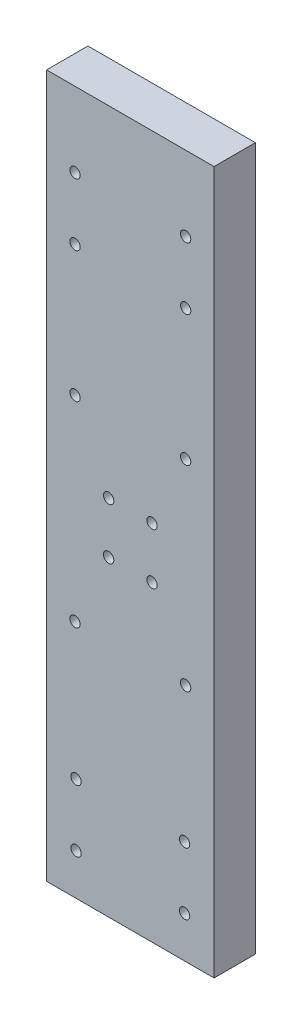
ISO-10303-21;
HEADER;
FILE_DESCRIPTION(('STEP AP214'),'2;1');
FILE_NAME('part.step','',(''),(''),'','','');
FILE_SCHEMA(('AUTOMOTIVE_DESIGN { 1 0 10303 214 1 1 1 1 }'));
ENDSEC;
DATA;
#1=APPLICATION_CONTEXT('core data for automotive mechanical design processes');
#2=APPLICATION_PROTOCOL_DEFINITION('international standard','automotive_design',2000,#1);
#3=PRODUCT_CONTEXT('',#1,'mechanical');
#4=PRODUCT('Part','Part','',(#3));
#5=PRODUCT_RELATED_PRODUCT_CATEGORY('part','',(#4));
#6=PRODUCT_DEFINITION_FORMATION('','',#4);
#7=PRODUCT_DEFINITION_CONTEXT('part definition',#1,'design');
#8=PRODUCT_DEFINITION('design','',#6,#7);
#9=PRODUCT_DEFINITION_SHAPE('','',#8);
#10=(LENGTH_UNIT() NAMED_UNIT(*) SI_UNIT(.MILLI.,.METRE.));
#11=(NAMED_UNIT(*) PLANE_ANGLE_UNIT() SI_UNIT($,.RADIAN.));
#12=(NAMED_UNIT(*) SI_UNIT($,.STERADIAN.) SOLID_ANGLE_UNIT());
#13=UNCERTAINTY_MEASURE_WITH_UNIT(LENGTH_MEASURE(1.E-05),#10,'distance_accuracy_value','');
#14=(GEOMETRIC_REPRESENTATION_CONTEXT(3) GLOBAL_UNCERTAINTY_ASSIGNED_CONTEXT((#13)) GLOBAL_UNIT_ASSIGNED_CONTEXT((#10,
#11,#12)) REPRESENTATION_CONTEXT('',''));
#15=CARTESIAN_POINT('',(0.,0.,0.));
#16=DIRECTION('',(0.,0.,1.));
#17=DIRECTION('',(1.,0.,0.));
#18=AXIS2_PLACEMENT_3D('',#15,#16,#17);
#19=CARTESIAN_POINT('',(0.,0.,4.));
#20=DIRECTION('',(0.,0.,-1.));
#21=DIRECTION('',(-1.,0.,0.));
#22=AXIS2_PLACEMENT_3D('',#19,#20,#21);
#23=PLANE('',#22);
#24=CARTESIAN_POINT('',(13.350000000001,4.,4.));
#25=DIRECTION('',(0.,0.,1.));
#26=DIRECTION('',(-1.,0.,0.));
#27=AXIS2_PLACEMENT_3D('',#24,#25,#26);
#28=CIRCLE('',#27,0.499999999999995);
#29=CARTESIAN_POINT('',(12.850000000001,4.,4.));
#30=VERTEX_POINT('',#29);
#31=EDGE_CURVE('E192',#30,#30,#28,.T.);
#32=ORIENTED_EDGE('',*,*,#31,.F.);
#33=EDGE_LOOP('',(#32));
#34=FACE_BOUND('',#33,.T.);
#35=CARTESIAN_POINT('',(2.84999999999999,4.,4.));
#36=DIRECTION('',(0.,0.,1.));
#37=DIRECTION('',(1.,0.,0.));
#38=AXIS2_PLACEMENT_3D('',#35,#36,#37);
#39=CIRCLE('',#38,0.499999999999999);
#40=CARTESIAN_POINT('',(3.34999999999999,4.,4.));
#41=VERTEX_POINT('',#40);
#42=EDGE_CURVE('E180',#41,#41,#39,.T.);
#43=ORIENTED_EDGE('',*,*,#42,.F.);
#44=EDGE_LOOP('',(#43));
#45=FACE_BOUND('',#44,.T.);
#46=CARTESIAN_POINT('',(2.75000000000003,42.11,4.));
#47=DIRECTION('',(0.,0.,1.));
#48=DIRECTION('',(1.,0.,0.));
#49=AXIS2_PLACEMENT_3D('',#46,#47,#48);
#50=CIRCLE('',#49,0.499999999999999);
#51=CARTESIAN_POINT('',(3.25000000000003,42.11,4.));
#52=VERTEX_POINT('',#51);
#53=EDGE_CURVE('E168',#52,#52,#50,.T.);
#54=ORIENTED_EDGE('',*,*,#53,.F.);
#55=EDGE_LOOP('',(#54));
#56=FACE_BOUND('',#55,.T.);
#57=CARTESIAN_POINT('',(13.45,42.11,4.));
#58=DIRECTION('',(0.,0.,1.));
#59=DIRECTION('',(1.,0.,0.));
#60=AXIS2_PLACEMENT_3D('',#57,#58,#59);
#61=CIRCLE('',#60,0.499999999999999);
#62=CARTESIAN_POINT('',(13.95,42.11,4.));
#63=VERTEX_POINT('',#62);
#64=EDGE_CURVE('E156',#63,#63,#61,.T.);
#65=ORIENTED_EDGE('',*,*,#64,.F.);
#66=EDGE_LOOP('',(#65));
#67=FACE_BOUND('',#66,.T.);
#68=CARTESIAN_POINT('',(2.75000000000003,23.15,4.));
#69=DIRECTION('',(0.,0.,1.));
#70=DIRECTION('',(1.,0.,0.));
#71=AXIS2_PLACEMENT_3D('',#68,#69,#70);
#72=CIRCLE('',#71,0.499999999999999);
#73=CARTESIAN_POINT('',(3.25000000000003,23.15,4.));
#74=VERTEX_POINT('',#73);
#75=EDGE_CURVE('E144',#74,#74,#72,.T.);
#76=ORIENTED_EDGE('',*,*,#75,.F.);
#77=EDGE_LOOP('',(#76));
#78=FACE_BOUND('',#77,.T.);
#79=CARTESIAN_POINT('',(13.4500000000001,23.15,4.));
#80=DIRECTION('',(0.,0.,1.));
#81=DIRECTION('',(1.,0.,0.));
#82=AXIS2_PLACEMENT_3D('',#79,#80,#81);
#83=CIRCLE('',#82,0.499999999999999);
#84=CARTESIAN_POINT('',(13.9500000000001,23.15,4.));
#85=VERTEX_POINT('',#84);
#86=EDGE_CURVE('E132',#85,#85,#83,.T.);
#87=ORIENTED_EDGE('',*,*,#86,.F.);
#88=EDGE_LOOP('',(#87));
#89=FACE_BOUND('',#88,.T.);
#90=CARTESIAN_POINT('',(10.2000000000001,30.15,4.));
#91=DIRECTION('',(0.,0.,1.));
#92=DIRECTION('',(1.,0.,0.));
#93=AXIS2_PLACEMENT_3D('',#90,#91,#92);
#94=CIRCLE('',#93,0.499999999999999);
#95=CARTESIAN_POINT('',(10.7000000000001,30.15,4.));
#96=VERTEX_POINT('',#95);
#97=EDGE_CURVE('E120',#96,#96,#94,.T.);
#98=ORIENTED_EDGE('',*,*,#97,.F.);
#99=EDGE_LOOP('',(#98));
#100=FACE_BOUND('',#99,.T.);
#101=CARTESIAN_POINT('',(13.45,60.76,4.));
#102=DIRECTION('',(0.,0.,1.));
#103=DIRECTION('',(1.,0.,0.));
#104=AXIS2_PLACEMENT_3D('',#101,#102,#103);
#105=CIRCLE('',#104,0.499999999999999);
#106=CARTESIAN_POINT('',(13.95,60.76,4.));
#107=VERTEX_POINT('',#106);
#108=EDGE_CURVE('E99',#107,#107,#105,.T.);
#109=ORIENTED_EDGE('',*,*,#108,.F.);
#110=EDGE_LOOP('',(#109));
#111=FACE_BOUND('',#110,.T.);
#112=DIRECTION('',(1.,0.,0.));
#113=VECTOR('',#112,1.);
#114=CARTESIAN_POINT('',(0.,0.,4.));
#115=LINE('',#114,#113);
#116=CARTESIAN_POINT('',(0.,0.,4.));
#117=VERTEX_POINT('',#116);
#118=CARTESIAN_POINT('',(16.2,0.,4.));
#119=VERTEX_POINT('',#118);
#120=EDGE_CURVE('E84',#117,#119,#115,.T.);
#121=ORIENTED_EDGE('',*,*,#120,.T.);
#122=DIRECTION('',(0.,1.,0.));
#123=VECTOR('',#122,1.);
#124=CARTESIAN_POINT('',(16.2,67.99,4.));
#125=LINE('',#124,#123);
#126=CARTESIAN_POINT('',(16.2,67.99,4.));
#127=VERTEX_POINT('',#126);
#128=EDGE_CURVE('E79',#119,#127,#125,.T.);
#129=ORIENTED_EDGE('',*,*,#128,.T.);
#130=DIRECTION('',(-1.,0.,0.));
#131=VECTOR('',#130,1.);
#132=CARTESIAN_POINT('',(0.,67.99,4.));
#133=LINE('',#132,#131);
#134=CARTESIAN_POINT('',(0.,67.99,4.));
#135=VERTEX_POINT('',#134);
#136=EDGE_CURVE('E82',#127,#135,#133,.T.);
#137=ORIENTED_EDGE('',*,*,#136,.T.);
#138=DIRECTION('',(0.,-1.,0.));
#139=VECTOR('',#138,1.);
#140=CARTESIAN_POINT('',(0.,0.,4.));
#141=LINE('',#140,#139);
#142=EDGE_CURVE('E49',#135,#117,#141,.T.);
#143=ORIENTED_EDGE('',*,*,#142,.T.);
#144=EDGE_LOOP('',(#121,#129,#137,#143));
#145=FACE_BOUND('',#144,.T.);
#146=CARTESIAN_POINT('',(2.75,60.76,4.));
#147=DIRECTION('',(0.,0.,1.));
#148=DIRECTION('',(1.,0.,0.));
#149=AXIS2_PLACEMENT_3D('',#146,#147,#148);
#150=CIRCLE('',#149,0.500000000000003);
#151=CARTESIAN_POINT('',(3.25,60.76,4.));
#152=VERTEX_POINT('',#151);
#153=EDGE_CURVE('E114',#152,#152,#150,.T.);
#154=ORIENTED_EDGE('',*,*,#153,.F.);
#155=EDGE_LOOP('',(#154));
#156=FACE_BOUND('',#155,.T.);
#157=CARTESIAN_POINT('',(6.00000000000001,30.15,4.));
#158=DIRECTION('',(0.,0.,1.));
#159=DIRECTION('',(1.,0.,0.));
#160=AXIS2_PLACEMENT_3D('',#157,#158,#159);
#161=CIRCLE('',#160,0.5);
#162=CARTESIAN_POINT('',(6.50000000000001,30.15,4.));
#163=VERTEX_POINT('',#162);
#164=EDGE_CURVE('E126',#163,#163,#161,.T.);
#165=ORIENTED_EDGE('',*,*,#164,.F.);
#166=EDGE_LOOP('',(#165));
#167=FACE_BOUND('',#166,.T.);
#168=CARTESIAN_POINT('',(10.2000000000001,35.11,4.));
#169=DIRECTION('',(0.,0.,1.));
#170=DIRECTION('',(1.,0.,0.));
#171=AXIS2_PLACEMENT_3D('',#168,#169,#170);
#172=CIRCLE('',#171,0.499999999999999);
#173=CARTESIAN_POINT('',(10.7000000000001,35.11,4.));
#174=VERTEX_POINT('',#173);
#175=EDGE_CURVE('E138',#174,#174,#172,.T.);
#176=ORIENTED_EDGE('',*,*,#175,.F.);
#177=EDGE_LOOP('',(#176));
#178=FACE_BOUND('',#177,.T.);
#179=CARTESIAN_POINT('',(6.00000000000001,35.11,4.));
#180=DIRECTION('',(0.,0.,1.));
#181=DIRECTION('',(1.,0.,0.));
#182=AXIS2_PLACEMENT_3D('',#179,#180,#181);
#183=CIRCLE('',#182,0.500000000000002);
#184=CARTESIAN_POINT('',(6.50000000000001,35.11,4.));
#185=VERTEX_POINT('',#184);
#186=EDGE_CURVE('E150',#185,#185,#183,.T.);
#187=ORIENTED_EDGE('',*,*,#186,.F.);
#188=EDGE_LOOP('',(#187));
#189=FACE_BOUND('',#188,.T.);
#190=CARTESIAN_POINT('',(2.84999999999999,10.,4.));
#191=DIRECTION('',(0.,0.,1.));
#192=DIRECTION('',(1.,0.,0.));
#193=AXIS2_PLACEMENT_3D('',#190,#191,#192);
#194=CIRCLE('',#193,0.499999999999999);
#195=CARTESIAN_POINT('',(3.34999999999999,10.,4.));
#196=VERTEX_POINT('',#195);
#197=EDGE_CURVE('E162',#196,#196,#194,.T.);
#198=ORIENTED_EDGE('',*,*,#197,.F.);
#199=EDGE_LOOP('',(#198));
#200=FACE_BOUND('',#199,.T.);
#201=CARTESIAN_POINT('',(13.4500000000019,54.76,4.));
#202=DIRECTION('',(0.,0.,1.));
#203=DIRECTION('',(1.,0.,0.));
#204=AXIS2_PLACEMENT_3D('',#201,#202,#203);
#205=CIRCLE('',#204,0.499999999999999);
#206=CARTESIAN_POINT('',(13.9500000000019,54.76,4.));
#207=VERTEX_POINT('',#206);
#208=EDGE_CURVE('E174',#207,#207,#205,.T.);
#209=ORIENTED_EDGE('',*,*,#208,.F.);
#210=EDGE_LOOP('',(#209));
#211=FACE_BOUND('',#210,.T.);
#212=CARTESIAN_POINT('',(13.350000000001,10.,4.));
#213=DIRECTION('',(0.,0.,1.));
#214=DIRECTION('',(-1.,0.,0.));
#215=AXIS2_PLACEMENT_3D('',#212,#213,#214);
#216=CIRCLE('',#215,0.499999999999994);
#217=CARTESIAN_POINT('',(12.850000000001,10.,4.));
#218=VERTEX_POINT('',#217);
#219=EDGE_CURVE('E186',#218,#218,#216,.T.);
#220=ORIENTED_EDGE('',*,*,#219,.F.);
#221=EDGE_LOOP('',(#220));
#222=FACE_BOUND('',#221,.T.);
#223=CARTESIAN_POINT('',(2.7500000000006,54.76,4.));
#224=DIRECTION('',(0.,0.,1.));
#225=DIRECTION('',(1.,0.,0.));
#226=AXIS2_PLACEMENT_3D('',#223,#224,#225);
#227=CIRCLE('',#226,0.500000000000005);
#228=CARTESIAN_POINT('',(3.2500000000006,54.76,4.));
#229=VERTEX_POINT('',#228);
#230=EDGE_CURVE('E198',#229,#229,#227,.T.);
#231=ORIENTED_EDGE('',*,*,#230,.F.);
#232=EDGE_LOOP('',(#231));
#233=FACE_BOUND('',#232,.T.);
#234=ADVANCED_FACE('F32',(#34,#45,#56,#67,#78,#89,#100,#111,#145,#156,#167,#178,#189,#200,#211,
#222,#233),#23,.F.);
#235=CARTESIAN_POINT('',(0.,0.,0.));
#236=DIRECTION('',(0.,0.,-1.));
#237=DIRECTION('',(-1.,0.,0.));
#238=AXIS2_PLACEMENT_3D('',#235,#236,#237);
#239=PLANE('',#238);
#240=CARTESIAN_POINT('',(13.350000000001,4.,0.));
#241=DIRECTION('',(0.,0.,1.));
#242=DIRECTION('',(-1.,0.,0.));
#243=AXIS2_PLACEMENT_3D('',#240,#241,#242);
#244=CIRCLE('',#243,0.499999999999995);
#245=CARTESIAN_POINT('',(12.850000000001,4.,0.));
#246=VERTEX_POINT('',#245);
#247=EDGE_CURVE('E195',#246,#246,#244,.T.);
#248=ORIENTED_EDGE('',*,*,#247,.T.);
#249=EDGE_LOOP('',(#248));
#250=FACE_BOUND('',#249,.T.);
#251=CARTESIAN_POINT('',(2.84999999999999,4.,0.));
#252=DIRECTION('',(0.,0.,1.));
#253=DIRECTION('',(1.,0.,0.));
#254=AXIS2_PLACEMENT_3D('',#251,#252,#253);
#255=CIRCLE('',#254,0.499999999999999);
#256=CARTESIAN_POINT('',(3.34999999999999,4.,0.));
#257=VERTEX_POINT('',#256);
#258=EDGE_CURVE('E183',#257,#257,#255,.T.);
#259=ORIENTED_EDGE('',*,*,#258,.T.);
#260=EDGE_LOOP('',(#259));
#261=FACE_BOUND('',#260,.T.);
#262=CARTESIAN_POINT('',(2.75000000000003,42.11,0.));
#263=DIRECTION('',(0.,0.,1.));
#264=DIRECTION('',(1.,0.,0.));
#265=AXIS2_PLACEMENT_3D('',#262,#263,#264);
#266=CIRCLE('',#265,0.499999999999999);
#267=CARTESIAN_POINT('',(3.25000000000003,42.11,0.));
#268=VERTEX_POINT('',#267);
#269=EDGE_CURVE('E171',#268,#268,#266,.T.);
#270=ORIENTED_EDGE('',*,*,#269,.T.);
#271=EDGE_LOOP('',(#270));
#272=FACE_BOUND('',#271,.T.);
#273=CARTESIAN_POINT('',(13.45,42.11,0.));
#274=DIRECTION('',(0.,0.,1.));
#275=DIRECTION('',(1.,0.,0.));
#276=AXIS2_PLACEMENT_3D('',#273,#274,#275);
#277=CIRCLE('',#276,0.499999999999999);
#278=CARTESIAN_POINT('',(13.95,42.11,0.));
#279=VERTEX_POINT('',#278);
#280=EDGE_CURVE('E159',#279,#279,#277,.T.);
#281=ORIENTED_EDGE('',*,*,#280,.T.);
#282=EDGE_LOOP('',(#281));
#283=FACE_BOUND('',#282,.T.);
#284=CARTESIAN_POINT('',(2.75000000000003,23.15,0.));
#285=DIRECTION('',(0.,0.,1.));
#286=DIRECTION('',(1.,0.,0.));
#287=AXIS2_PLACEMENT_3D('',#284,#285,#286);
#288=CIRCLE('',#287,0.499999999999999);
#289=CARTESIAN_POINT('',(3.25000000000003,23.15,0.));
#290=VERTEX_POINT('',#289);
#291=EDGE_CURVE('E147',#290,#290,#288,.T.);
#292=ORIENTED_EDGE('',*,*,#291,.T.);
#293=EDGE_LOOP('',(#292));
#294=FACE_BOUND('',#293,.T.);
#295=CARTESIAN_POINT('',(13.4500000000001,23.15,0.));
#296=DIRECTION('',(0.,0.,1.));
#297=DIRECTION('',(1.,0.,0.));
#298=AXIS2_PLACEMENT_3D('',#295,#296,#297);
#299=CIRCLE('',#298,0.499999999999999);
#300=CARTESIAN_POINT('',(13.9500000000001,23.15,0.));
#301=VERTEX_POINT('',#300);
#302=EDGE_CURVE('E135',#301,#301,#299,.T.);
#303=ORIENTED_EDGE('',*,*,#302,.T.);
#304=EDGE_LOOP('',(#303));
#305=FACE_BOUND('',#304,.T.);
#306=CARTESIAN_POINT('',(10.2000000000001,30.15,0.));
#307=DIRECTION('',(0.,0.,1.));
#308=DIRECTION('',(1.,0.,0.));
#309=AXIS2_PLACEMENT_3D('',#306,#307,#308);
#310=CIRCLE('',#309,0.499999999999999);
#311=CARTESIAN_POINT('',(10.7000000000001,30.15,0.));
#312=VERTEX_POINT('',#311);
#313=EDGE_CURVE('E123',#312,#312,#310,.T.);
#314=ORIENTED_EDGE('',*,*,#313,.T.);
#315=EDGE_LOOP('',(#314));
#316=FACE_BOUND('',#315,.T.);
#317=CARTESIAN_POINT('',(13.45,60.76,0.));
#318=DIRECTION('',(0.,0.,1.));
#319=DIRECTION('',(1.,0.,0.));
#320=AXIS2_PLACEMENT_3D('',#317,#318,#319);
#321=CIRCLE('',#320,0.499999999999999);
#322=CARTESIAN_POINT('',(13.95,60.76,0.));
#323=VERTEX_POINT('',#322);
#324=EDGE_CURVE('E111',#323,#323,#321,.T.);
#325=ORIENTED_EDGE('',*,*,#324,.T.);
#326=EDGE_LOOP('',(#325));
#327=FACE_BOUND('',#326,.T.);
#328=DIRECTION('',(1.,0.,0.));
#329=VECTOR('',#328,1.);
#330=CARTESIAN_POINT('',(0.,0.,0.));
#331=LINE('',#330,#329);
#332=CARTESIAN_POINT('',(0.,0.,0.));
#333=VERTEX_POINT('',#332);
#334=CARTESIAN_POINT('',(16.2,0.,0.));
#335=VERTEX_POINT('',#334);
#336=EDGE_CURVE('E96',#333,#335,#331,.T.);
#337=ORIENTED_EDGE('',*,*,#336,.F.);
#338=DIRECTION('',(0.,-1.,0.));
#339=VECTOR('',#338,1.);
#340=CARTESIAN_POINT('',(0.,0.,0.));
#341=LINE('',#340,#339);
#342=CARTESIAN_POINT('',(0.,67.99,0.));
#343=VERTEX_POINT('',#342);
#344=EDGE_CURVE('E72',#343,#333,#341,.T.);
#345=ORIENTED_EDGE('',*,*,#344,.F.);
#346=DIRECTION('',(-1.,0.,0.));
#347=VECTOR('',#346,1.);
#348=CARTESIAN_POINT('',(0.,67.99,0.));
#349=LINE('',#348,#347);
#350=CARTESIAN_POINT('',(16.2,67.99,0.));
#351=VERTEX_POINT('',#350);
#352=EDGE_CURVE('E66',#351,#343,#349,.T.);
#353=ORIENTED_EDGE('',*,*,#352,.F.);
#354=DIRECTION('',(0.,1.,0.));
#355=VECTOR('',#354,1.);
#356=CARTESIAN_POINT('',(16.2,67.99,0.));
#357=LINE('',#356,#355);
#358=EDGE_CURVE('E88',#335,#351,#357,.T.);
#359=ORIENTED_EDGE('',*,*,#358,.F.);
#360=EDGE_LOOP('',(#337,#345,#353,#359));
#361=FACE_BOUND('',#360,.T.);
#362=CARTESIAN_POINT('',(2.75,60.76,0.));
#363=DIRECTION('',(0.,0.,1.));
#364=DIRECTION('',(1.,0.,0.));
#365=AXIS2_PLACEMENT_3D('',#362,#363,#364);
#366=CIRCLE('',#365,0.500000000000003);
#367=CARTESIAN_POINT('',(3.25,60.76,0.));
#368=VERTEX_POINT('',#367);
#369=EDGE_CURVE('E117',#368,#368,#366,.T.);
#370=ORIENTED_EDGE('',*,*,#369,.T.);
#371=EDGE_LOOP('',(#370));
#372=FACE_BOUND('',#371,.T.);
#373=CARTESIAN_POINT('',(6.00000000000001,30.15,0.));
#374=DIRECTION('',(0.,0.,1.));
#375=DIRECTION('',(1.,0.,0.));
#376=AXIS2_PLACEMENT_3D('',#373,#374,#375);
#377=CIRCLE('',#376,0.5);
#378=CARTESIAN_POINT('',(6.50000000000001,30.15,0.));
#379=VERTEX_POINT('',#378);
#380=EDGE_CURVE('E129',#379,#379,#377,.T.);
#381=ORIENTED_EDGE('',*,*,#380,.T.);
#382=EDGE_LOOP('',(#381));
#383=FACE_BOUND('',#382,.T.);
#384=CARTESIAN_POINT('',(10.2000000000001,35.11,0.));
#385=DIRECTION('',(0.,0.,1.));
#386=DIRECTION('',(1.,0.,0.));
#387=AXIS2_PLACEMENT_3D('',#384,#385,#386);
#388=CIRCLE('',#387,0.499999999999999);
#389=CARTESIAN_POINT('',(10.7000000000001,35.11,0.));
#390=VERTEX_POINT('',#389);
#391=EDGE_CURVE('E141',#390,#390,#388,.T.);
#392=ORIENTED_EDGE('',*,*,#391,.T.);
#393=EDGE_LOOP('',(#392));
#394=FACE_BOUND('',#393,.T.);
#395=CARTESIAN_POINT('',(6.00000000000001,35.11,0.));
#396=DIRECTION('',(0.,0.,1.));
#397=DIRECTION('',(1.,0.,0.));
#398=AXIS2_PLACEMENT_3D('',#395,#396,#397);
#399=CIRCLE('',#398,0.500000000000002);
#400=CARTESIAN_POINT('',(6.50000000000001,35.11,0.));
#401=VERTEX_POINT('',#400);
#402=EDGE_CURVE('E153',#401,#401,#399,.T.);
#403=ORIENTED_EDGE('',*,*,#402,.T.);
#404=EDGE_LOOP('',(#403));
#405=FACE_BOUND('',#404,.T.);
#406=CARTESIAN_POINT('',(2.84999999999999,10.,0.));
#407=DIRECTION('',(0.,0.,1.));
#408=DIRECTION('',(1.,0.,0.));
#409=AXIS2_PLACEMENT_3D('',#406,#407,#408);
#410=CIRCLE('',#409,0.499999999999999);
#411=CARTESIAN_POINT('',(3.34999999999999,10.,0.));
#412=VERTEX_POINT('',#411);
#413=EDGE_CURVE('E165',#412,#412,#410,.T.);
#414=ORIENTED_EDGE('',*,*,#413,.T.);
#415=EDGE_LOOP('',(#414));
#416=FACE_BOUND('',#415,.T.);
#417=CARTESIAN_POINT('',(13.4500000000019,54.76,0.));
#418=DIRECTION('',(0.,0.,1.));
#419=DIRECTION('',(1.,0.,0.));
#420=AXIS2_PLACEMENT_3D('',#417,#418,#419);
#421=CIRCLE('',#420,0.499999999999999);
#422=CARTESIAN_POINT('',(13.9500000000019,54.76,0.));
#423=VERTEX_POINT('',#422);
#424=EDGE_CURVE('E177',#423,#423,#421,.T.);
#425=ORIENTED_EDGE('',*,*,#424,.T.);
#426=EDGE_LOOP('',(#425));
#427=FACE_BOUND('',#426,.T.);
#428=CARTESIAN_POINT('',(13.350000000001,10.,0.));
#429=DIRECTION('',(0.,0.,1.));
#430=DIRECTION('',(-1.,0.,0.));
#431=AXIS2_PLACEMENT_3D('',#428,#429,#430);
#432=CIRCLE('',#431,0.499999999999994);
#433=CARTESIAN_POINT('',(12.850000000001,10.,0.));
#434=VERTEX_POINT('',#433);
#435=EDGE_CURVE('E189',#434,#434,#432,.T.);
#436=ORIENTED_EDGE('',*,*,#435,.T.);
#437=EDGE_LOOP('',(#436));
#438=FACE_BOUND('',#437,.T.);
#439=CARTESIAN_POINT('',(2.7500000000006,54.76,0.));
#440=DIRECTION('',(0.,0.,1.));
#441=DIRECTION('',(1.,0.,0.));
#442=AXIS2_PLACEMENT_3D('',#439,#440,#441);
#443=CIRCLE('',#442,0.500000000000005);
#444=CARTESIAN_POINT('',(3.2500000000006,54.76,0.));
#445=VERTEX_POINT('',#444);
#446=EDGE_CURVE('E201',#445,#445,#443,.T.);
#447=ORIENTED_EDGE('',*,*,#446,.T.);
#448=EDGE_LOOP('',(#447));
#449=FACE_BOUND('',#448,.T.);
#450=ADVANCED_FACE('F107',(#250,#261,#272,#283,#294,#305,#316,#327,#361,#372,#383,#394,#405,
#416,#427,#438,#449),#239,.T.);
#451=CARTESIAN_POINT('',(0.,0.,4.));
#452=DIRECTION('',(0.,1.,0.));
#453=DIRECTION('',(0.,0.,1.));
#454=AXIS2_PLACEMENT_3D('',#451,#452,#453);
#455=PLANE('',#454);
#456=ORIENTED_EDGE('',*,*,#336,.T.);
#457=DIRECTION('',(0.,0.,-1.));
#458=VECTOR('',#457,1.);
#459=CARTESIAN_POINT('',(16.2,0.,4.));
#460=LINE('',#459,#458);
#461=EDGE_CURVE('E11',#119,#335,#460,.T.);
#462=ORIENTED_EDGE('',*,*,#461,.F.);
#463=ORIENTED_EDGE('',*,*,#120,.F.);
#464=DIRECTION('',(0.,0.,-1.));
#465=VECTOR('',#464,1.);
#466=CARTESIAN_POINT('',(0.,0.,4.));
#467=LINE('',#466,#465);
#468=EDGE_CURVE('E92',#117,#333,#467,.T.);
#469=ORIENTED_EDGE('',*,*,#468,.T.);
#470=EDGE_LOOP('',(#456,#462,#463,#469));
#471=FACE_BOUND('',#470,.T.);
#472=ADVANCED_FACE('F34',(#471),#455,.F.);
#473=CARTESIAN_POINT('',(16.2,67.99,4.));
#474=DIRECTION('',(-1.,0.,0.));
#475=DIRECTION('',(0.,-1.,0.));
#476=AXIS2_PLACEMENT_3D('',#473,#474,#475);
#477=PLANE('',#476);
#478=ORIENTED_EDGE('',*,*,#358,.T.);
#479=DIRECTION('',(0.,0.,-1.));
#480=VECTOR('',#479,1.);
#481=CARTESIAN_POINT('',(16.2,67.99,4.));
#482=LINE('',#481,#480);
#483=EDGE_CURVE('E41',#127,#351,#482,.T.);
#484=ORIENTED_EDGE('',*,*,#483,.F.);
#485=ORIENTED_EDGE('',*,*,#128,.F.);
#486=ORIENTED_EDGE('',*,*,#461,.T.);
#487=EDGE_LOOP('',(#478,#484,#485,#486));
#488=FACE_BOUND('',#487,.T.);
#489=ADVANCED_FACE('F87',(#488),#477,.F.);
#490=CARTESIAN_POINT('',(0.,67.99,4.));
#491=DIRECTION('',(0.,-1.,0.));
#492=DIRECTION('',(0.,0.,-1.));
#493=AXIS2_PLACEMENT_3D('',#490,#491,#492);
#494=PLANE('',#493);
#495=ORIENTED_EDGE('',*,*,#352,.T.);
#496=DIRECTION('',(0.,0.,-1.));
#497=VECTOR('',#496,1.);
#498=CARTESIAN_POINT('',(0.,67.99,4.));
#499=LINE('',#498,#497);
#500=EDGE_CURVE('E89',#135,#343,#499,.T.);
#501=ORIENTED_EDGE('',*,*,#500,.F.);
#502=ORIENTED_EDGE('',*,*,#136,.F.);
#503=ORIENTED_EDGE('',*,*,#483,.T.);
#504=EDGE_LOOP('',(#495,#501,#502,#503));
#505=FACE_BOUND('',#504,.T.);
#506=ADVANCED_FACE('F90',(#505),#494,.F.);
#507=CARTESIAN_POINT('',(0.,0.,4.));
#508=DIRECTION('',(1.,0.,0.));
#509=DIRECTION('',(0.,0.,-1.));
#510=AXIS2_PLACEMENT_3D('',#507,#508,#509);
#511=PLANE('',#510);
#512=ORIENTED_EDGE('',*,*,#344,.T.);
#513=ORIENTED_EDGE('',*,*,#468,.F.);
#514=ORIENTED_EDGE('',*,*,#142,.F.);
#515=ORIENTED_EDGE('',*,*,#500,.T.);
#516=EDGE_LOOP('',(#512,#513,#514,#515));
#517=FACE_BOUND('',#516,.T.);
#518=ADVANCED_FACE('F104',(#517),#511,.F.);
#519=CARTESIAN_POINT('',(13.45,60.76,4.));
#520=DIRECTION('',(0.,0.,-1.));
#521=DIRECTION('',(-1.,0.,0.));
#522=AXIS2_PLACEMENT_3D('',#519,#520,#521);
#523=CYLINDRICAL_SURFACE('',#522,0.499999999999999);
#524=ORIENTED_EDGE('',*,*,#108,.T.);
#525=EDGE_LOOP('',(#524));
#526=FACE_BOUND('',#525,.T.);
#527=ORIENTED_EDGE('',*,*,#324,.F.);
#528=EDGE_LOOP('',(#527));
#529=FACE_BOUND('',#528,.T.);
#530=ADVANCED_FACE('F221',(#526,#529),#523,.F.);
#531=CARTESIAN_POINT('',(2.75,60.76,4.));
#532=DIRECTION('',(0.,0.,-1.));
#533=DIRECTION('',(-1.,0.,0.));
#534=AXIS2_PLACEMENT_3D('',#531,#532,#533);
#535=CYLINDRICAL_SURFACE('',#534,0.500000000000003);
#536=ORIENTED_EDGE('',*,*,#153,.T.);
#537=EDGE_LOOP('',(#536));
#538=FACE_BOUND('',#537,.T.);
#539=ORIENTED_EDGE('',*,*,#369,.F.);
#540=EDGE_LOOP('',(#539));
#541=FACE_BOUND('',#540,.T.);
#542=ADVANCED_FACE('F267',(#538,#541),#535,.F.);
#543=CARTESIAN_POINT('',(10.2000000000001,30.15,4.));
#544=DIRECTION('',(0.,0.,-1.));
#545=DIRECTION('',(-1.,0.,0.));
#546=AXIS2_PLACEMENT_3D('',#543,#544,#545);
#547=CYLINDRICAL_SURFACE('',#546,0.499999999999999);
#548=ORIENTED_EDGE('',*,*,#97,.T.);
#549=EDGE_LOOP('',(#548));
#550=FACE_BOUND('',#549,.T.);
#551=ORIENTED_EDGE('',*,*,#313,.F.);
#552=EDGE_LOOP('',(#551));
#553=FACE_BOUND('',#552,.T.);
#554=ADVANCED_FACE('F275',(#550,#553),#547,.F.);
#555=CARTESIAN_POINT('',(6.00000000000001,30.15,4.));
#556=DIRECTION('',(0.,0.,-1.));
#557=DIRECTION('',(-1.,0.,0.));
#558=AXIS2_PLACEMENT_3D('',#555,#556,#557);
#559=CYLINDRICAL_SURFACE('',#558,0.5);
#560=ORIENTED_EDGE('',*,*,#164,.T.);
#561=EDGE_LOOP('',(#560));
#562=FACE_BOUND('',#561,.T.);
#563=ORIENTED_EDGE('',*,*,#380,.F.);
#564=EDGE_LOOP('',(#563));
#565=FACE_BOUND('',#564,.T.);
#566=ADVANCED_FACE('F283',(#562,#565),#559,.F.);
#567=CARTESIAN_POINT('',(13.4500000000001,23.15,4.));
#568=DIRECTION('',(0.,0.,-1.));
#569=DIRECTION('',(-1.,0.,0.));
#570=AXIS2_PLACEMENT_3D('',#567,#568,#569);
#571=CYLINDRICAL_SURFACE('',#570,0.499999999999999);
#572=ORIENTED_EDGE('',*,*,#86,.T.);
#573=EDGE_LOOP('',(#572));
#574=FACE_BOUND('',#573,.T.);
#575=ORIENTED_EDGE('',*,*,#302,.F.);
#576=EDGE_LOOP('',(#575));
#577=FACE_BOUND('',#576,.T.);
#578=ADVANCED_FACE('F292',(#574,#577),#571,.F.);
#579=CARTESIAN_POINT('',(10.2000000000001,35.11,4.));
#580=DIRECTION('',(0.,0.,-1.));
#581=DIRECTION('',(-1.,0.,0.));
#582=AXIS2_PLACEMENT_3D('',#579,#580,#581);
#583=CYLINDRICAL_SURFACE('',#582,0.499999999999999);
#584=ORIENTED_EDGE('',*,*,#175,.T.);
#585=EDGE_LOOP('',(#584));
#586=FACE_BOUND('',#585,.T.);
#587=ORIENTED_EDGE('',*,*,#391,.F.);
#588=EDGE_LOOP('',(#587));
#589=FACE_BOUND('',#588,.T.);
#590=ADVANCED_FACE('F301',(#586,#589),#583,.F.);
#591=CARTESIAN_POINT('',(2.75000000000003,23.15,4.));
#592=DIRECTION('',(0.,0.,-1.));
#593=DIRECTION('',(-1.,0.,0.));
#594=AXIS2_PLACEMENT_3D('',#591,#592,#593);
#595=CYLINDRICAL_SURFACE('',#594,0.499999999999999);
#596=ORIENTED_EDGE('',*,*,#75,.T.);
#597=EDGE_LOOP('',(#596));
#598=FACE_BOUND('',#597,.T.);
#599=ORIENTED_EDGE('',*,*,#291,.F.);
#600=EDGE_LOOP('',(#599));
#601=FACE_BOUND('',#600,.T.);
#602=ADVANCED_FACE('F310',(#598,#601),#595,.F.);
#603=CARTESIAN_POINT('',(6.00000000000001,35.11,4.));
#604=DIRECTION('',(0.,0.,-1.));
#605=DIRECTION('',(-1.,0.,0.));
#606=AXIS2_PLACEMENT_3D('',#603,#604,#605);
#607=CYLINDRICAL_SURFACE('',#606,0.500000000000002);
#608=ORIENTED_EDGE('',*,*,#186,.T.);
#609=EDGE_LOOP('',(#608));
#610=FACE_BOUND('',#609,.T.);
#611=ORIENTED_EDGE('',*,*,#402,.F.);
#612=EDGE_LOOP('',(#611));
#613=FACE_BOUND('',#612,.T.);
#614=ADVANCED_FACE('F319',(#610,#613),#607,.F.);
#615=CARTESIAN_POINT('',(13.45,42.11,4.));
#616=DIRECTION('',(0.,0.,-1.));
#617=DIRECTION('',(-1.,0.,0.));
#618=AXIS2_PLACEMENT_3D('',#615,#616,#617);
#619=CYLINDRICAL_SURFACE('',#618,0.499999999999999);
#620=ORIENTED_EDGE('',*,*,#64,.T.);
#621=EDGE_LOOP('',(#620));
#622=FACE_BOUND('',#621,.T.);
#623=ORIENTED_EDGE('',*,*,#280,.F.);
#624=EDGE_LOOP('',(#623));
#625=FACE_BOUND('',#624,.T.);
#626=ADVANCED_FACE('F328',(#622,#625),#619,.F.);
#627=CARTESIAN_POINT('',(2.84999999999999,10.,4.));
#628=DIRECTION('',(0.,0.,-1.));
#629=DIRECTION('',(-1.,0.,0.));
#630=AXIS2_PLACEMENT_3D('',#627,#628,#629);
#631=CYLINDRICAL_SURFACE('',#630,0.499999999999999);
#632=ORIENTED_EDGE('',*,*,#197,.T.);
#633=EDGE_LOOP('',(#632));
#634=FACE_BOUND('',#633,.T.);
#635=ORIENTED_EDGE('',*,*,#413,.F.);
#636=EDGE_LOOP('',(#635));
#637=FACE_BOUND('',#636,.T.);
#638=ADVANCED_FACE('F337',(#634,#637),#631,.F.);
#639=CARTESIAN_POINT('',(2.75000000000003,42.11,4.));
#640=DIRECTION('',(0.,0.,-1.));
#641=DIRECTION('',(-1.,0.,0.));
#642=AXIS2_PLACEMENT_3D('',#639,#640,#641);
#643=CYLINDRICAL_SURFACE('',#642,0.499999999999999);
#644=ORIENTED_EDGE('',*,*,#53,.T.);
#645=EDGE_LOOP('',(#644));
#646=FACE_BOUND('',#645,.T.);
#647=ORIENTED_EDGE('',*,*,#269,.F.);
#648=EDGE_LOOP('',(#647));
#649=FACE_BOUND('',#648,.T.);
#650=ADVANCED_FACE('F346',(#646,#649),#643,.F.);
#651=CARTESIAN_POINT('',(13.4500000000019,54.76,4.));
#652=DIRECTION('',(0.,0.,-1.));
#653=DIRECTION('',(-1.,0.,0.));
#654=AXIS2_PLACEMENT_3D('',#651,#652,#653);
#655=CYLINDRICAL_SURFACE('',#654,0.499999999999999);
#656=ORIENTED_EDGE('',*,*,#208,.T.);
#657=EDGE_LOOP('',(#656));
#658=FACE_BOUND('',#657,.T.);
#659=ORIENTED_EDGE('',*,*,#424,.F.);
#660=EDGE_LOOP('',(#659));
#661=FACE_BOUND('',#660,.T.);
#662=ADVANCED_FACE('F355',(#658,#661),#655,.F.);
#663=CARTESIAN_POINT('',(2.84999999999999,4.,4.));
#664=DIRECTION('',(0.,0.,-1.));
#665=DIRECTION('',(-1.,0.,0.));
#666=AXIS2_PLACEMENT_3D('',#663,#664,#665);
#667=CYLINDRICAL_SURFACE('',#666,0.499999999999999);
#668=ORIENTED_EDGE('',*,*,#42,.T.);
#669=EDGE_LOOP('',(#668));
#670=FACE_BOUND('',#669,.T.);
#671=ORIENTED_EDGE('',*,*,#258,.F.);
#672=EDGE_LOOP('',(#671));
#673=FACE_BOUND('',#672,.T.);
#674=ADVANCED_FACE('F364',(#670,#673),#667,.F.);
#675=CARTESIAN_POINT('',(13.350000000001,10.,4.));
#676=DIRECTION('',(0.,0.,-1.));
#677=DIRECTION('',(-1.,0.,0.));
#678=AXIS2_PLACEMENT_3D('',#675,#676,#677);
#679=CYLINDRICAL_SURFACE('',#678,0.499999999999994);
#680=ORIENTED_EDGE('',*,*,#219,.T.);
#681=EDGE_LOOP('',(#680));
#682=FACE_BOUND('',#681,.T.);
#683=ORIENTED_EDGE('',*,*,#435,.F.);
#684=EDGE_LOOP('',(#683));
#685=FACE_BOUND('',#684,.T.);
#686=ADVANCED_FACE('F373',(#682,#685),#679,.F.);
#687=CARTESIAN_POINT('',(13.350000000001,4.,4.));
#688=DIRECTION('',(0.,0.,-1.));
#689=DIRECTION('',(-1.,0.,0.));
#690=AXIS2_PLACEMENT_3D('',#687,#688,#689);
#691=CYLINDRICAL_SURFACE('',#690,0.499999999999995);
#692=ORIENTED_EDGE('',*,*,#31,.T.);
#693=EDGE_LOOP('',(#692));
#694=FACE_BOUND('',#693,.T.);
#695=ORIENTED_EDGE('',*,*,#247,.F.);
#696=EDGE_LOOP('',(#695));
#697=FACE_BOUND('',#696,.T.);
#698=ADVANCED_FACE('F382',(#694,#697),#691,.F.);
#699=CARTESIAN_POINT('',(2.7500000000006,54.76,4.));
#700=DIRECTION('',(0.,0.,-1.));
#701=DIRECTION('',(-1.,0.,0.));
#702=AXIS2_PLACEMENT_3D('',#699,#700,#701);
#703=CYLINDRICAL_SURFACE('',#702,0.500000000000005);
#704=ORIENTED_EDGE('',*,*,#230,.T.);
#705=EDGE_LOOP('',(#704));
#706=FACE_BOUND('',#705,.T.);
#707=ORIENTED_EDGE('',*,*,#446,.F.);
#708=EDGE_LOOP('',(#707));
#709=FACE_BOUND('',#708,.T.);
#710=ADVANCED_FACE('F207',(#706,#709),#703,.F.);
#711=CLOSED_SHELL('',(#234,#450,#472,#489,#506,#518,#530,#542,#554,#566,#578,#590,#602,#614,
#626,#638,#650,#662,#674,#686,#698,#710));
#712=MANIFOLD_SOLID_BREP('B2',#711);
#713=ADVANCED_BREP_SHAPE_REPRESENTATION('',(#18,#712),#14);
#714=SHAPE_DEFINITION_REPRESENTATION(#9,#713);
ENDSEC;
END-ISO-10303-21;
